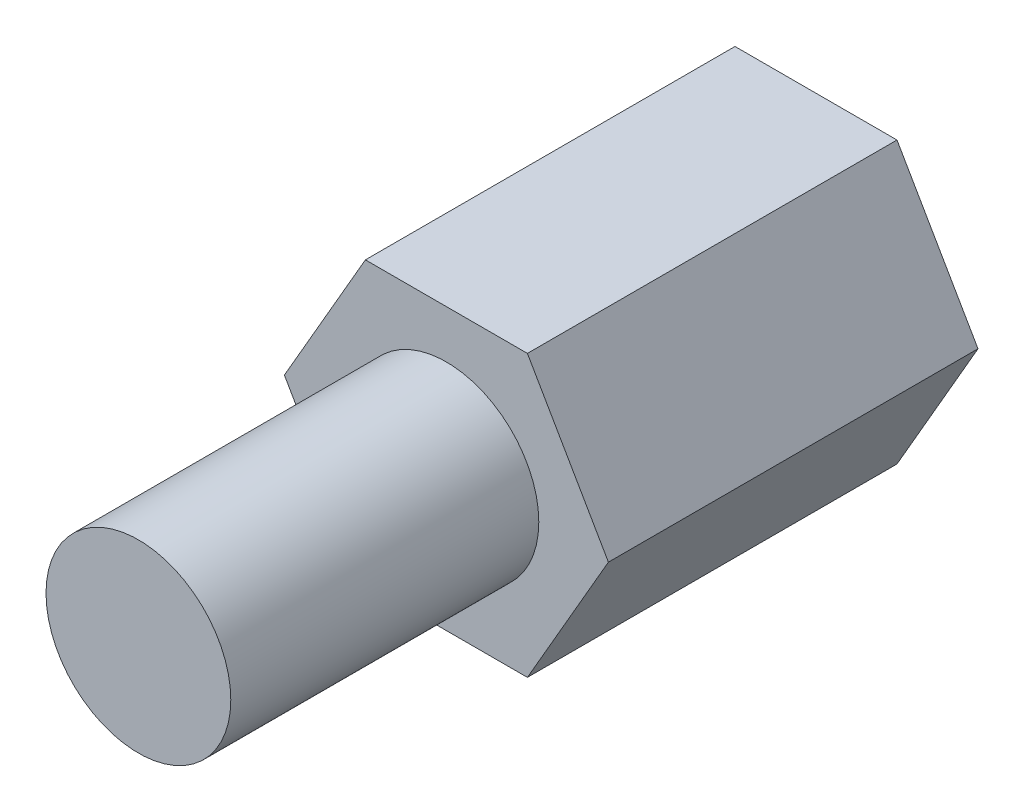
ISO-10303-21;
HEADER;
FILE_DESCRIPTION(('STEP AP214'),'2;1');
FILE_NAME('part.step','',(''),(''),'','','');
FILE_SCHEMA(('AUTOMOTIVE_DESIGN { 1 0 10303 214 1 1 1 1 }'));
ENDSEC;
DATA;
#1=APPLICATION_CONTEXT('core data for automotive mechanical design processes');
#2=APPLICATION_PROTOCOL_DEFINITION('international standard','automotive_design',2000,#1);
#3=PRODUCT_CONTEXT('',#1,'mechanical');
#4=PRODUCT('Part','Part','',(#3));
#5=PRODUCT_RELATED_PRODUCT_CATEGORY('part','',(#4));
#6=PRODUCT_DEFINITION_FORMATION('','',#4);
#7=PRODUCT_DEFINITION_CONTEXT('part definition',#1,'design');
#8=PRODUCT_DEFINITION('design','',#6,#7);
#9=PRODUCT_DEFINITION_SHAPE('','',#8);
#10=(LENGTH_UNIT() NAMED_UNIT(*) SI_UNIT(.MILLI.,.METRE.));
#11=(NAMED_UNIT(*) PLANE_ANGLE_UNIT() SI_UNIT($,.RADIAN.));
#12=(NAMED_UNIT(*) SI_UNIT($,.STERADIAN.) SOLID_ANGLE_UNIT());
#13=UNCERTAINTY_MEASURE_WITH_UNIT(LENGTH_MEASURE(1.E-05),#10,'distance_accuracy_value','');
#14=(GEOMETRIC_REPRESENTATION_CONTEXT(3) GLOBAL_UNCERTAINTY_ASSIGNED_CONTEXT((#13)) GLOBAL_UNIT_ASSIGNED_CONTEXT((#10,
#11,#12)) REPRESENTATION_CONTEXT('',''));
#15=CARTESIAN_POINT('',(0.,0.,0.));
#16=DIRECTION('',(0.,0.,1.));
#17=DIRECTION('',(1.,0.,0.));
#18=AXIS2_PLACEMENT_3D('',#15,#16,#17);
#19=CARTESIAN_POINT('',(1.315,-2.27764681195307,6.));
#20=DIRECTION('',(-0.866025403784439,0.5,0.));
#21=DIRECTION('',(-0.5,-0.866025403784439,0.));
#22=AXIS2_PLACEMENT_3D('',#19,#20,#21);
#23=PLANE('',#22);
#24=DIRECTION('',(0.5,0.866025403784439,0.));
#25=VECTOR('',#24,1.);
#26=CARTESIAN_POINT('',(1.315,-2.27764681195307,0.));
#27=LINE('',#26,#25);
#28=CARTESIAN_POINT('',(1.315,-2.27764681195307,0.));
#29=VERTEX_POINT('',#28);
#30=CARTESIAN_POINT('',(2.63,0.,0.));
#31=VERTEX_POINT('',#30);
#32=EDGE_CURVE('E127',#29,#31,#27,.T.);
#33=ORIENTED_EDGE('',*,*,#32,.T.);
#34=DIRECTION('',(0.,0.,-1.));
#35=VECTOR('',#34,1.);
#36=CARTESIAN_POINT('',(2.63,0.,6.));
#37=LINE('',#36,#35);
#38=CARTESIAN_POINT('',(2.63,0.,6.));
#39=VERTEX_POINT('',#38);
#40=EDGE_CURVE('E42',#39,#31,#37,.T.);
#41=ORIENTED_EDGE('',*,*,#40,.F.);
#42=DIRECTION('',(0.5,0.866025403784439,0.));
#43=VECTOR('',#42,1.);
#44=CARTESIAN_POINT('',(1.315,-2.27764681195307,6.));
#45=LINE('',#44,#43);
#46=CARTESIAN_POINT('',(1.315,-2.27764681195307,6.));
#47=VERTEX_POINT('',#46);
#48=EDGE_CURVE('E138',#47,#39,#45,.T.);
#49=ORIENTED_EDGE('',*,*,#48,.F.);
#50=DIRECTION('',(0.,0.,-1.));
#51=VECTOR('',#50,1.);
#52=CARTESIAN_POINT('',(1.315,-2.27764681195307,6.));
#53=LINE('',#52,#51);
#54=EDGE_CURVE('E123',#47,#29,#53,.T.);
#55=ORIENTED_EDGE('',*,*,#54,.T.);
#56=EDGE_LOOP('',(#33,#41,#49,#55));
#57=FACE_BOUND('',#56,.T.);
#58=ADVANCED_FACE('F39',(#57),#23,.F.);
#59=CARTESIAN_POINT('',(2.63,0.,6.));
#60=DIRECTION('',(-0.866025403784439,-0.5,0.));
#61=DIRECTION('',(0.5,-0.866025403784439,0.));
#62=AXIS2_PLACEMENT_3D('',#59,#60,#61);
#63=PLANE('',#62);
#64=DIRECTION('',(-0.5,0.866025403784439,0.));
#65=VECTOR('',#64,1.);
#66=CARTESIAN_POINT('',(2.63,0.,0.));
#67=LINE('',#66,#65);
#68=CARTESIAN_POINT('',(1.315,2.27764681195307,0.));
#69=VERTEX_POINT('',#68);
#70=EDGE_CURVE('E130',#31,#69,#67,.T.);
#71=ORIENTED_EDGE('',*,*,#70,.T.);
#72=DIRECTION('',(0.,0.,-1.));
#73=VECTOR('',#72,1.);
#74=CARTESIAN_POINT('',(1.315,2.27764681195307,6.));
#75=LINE('',#74,#73);
#76=CARTESIAN_POINT('',(1.315,2.27764681195307,6.));
#77=VERTEX_POINT('',#76);
#78=EDGE_CURVE('E141',#77,#69,#75,.T.);
#79=ORIENTED_EDGE('',*,*,#78,.F.);
#80=DIRECTION('',(-0.5,0.866025403784439,0.));
#81=VECTOR('',#80,1.);
#82=CARTESIAN_POINT('',(2.63,0.,6.));
#83=LINE('',#82,#81);
#84=EDGE_CURVE('E95',#39,#77,#83,.T.);
#85=ORIENTED_EDGE('',*,*,#84,.F.);
#86=ORIENTED_EDGE('',*,*,#40,.T.);
#87=EDGE_LOOP('',(#71,#79,#85,#86));
#88=FACE_BOUND('',#87,.T.);
#89=ADVANCED_FACE('F146',(#88),#63,.F.);
#90=CARTESIAN_POINT('',(1.315,2.27764681195307,6.));
#91=DIRECTION('',(0.,-1.,0.));
#92=DIRECTION('',(1.,0.,0.));
#93=AXIS2_PLACEMENT_3D('',#90,#91,#92);
#94=PLANE('',#93);
#95=DIRECTION('',(-1.,0.,0.));
#96=VECTOR('',#95,1.);
#97=CARTESIAN_POINT('',(1.315,2.27764681195307,0.));
#98=LINE('',#97,#96);
#99=CARTESIAN_POINT('',(-1.315,2.27764681195307,0.));
#100=VERTEX_POINT('',#99);
#101=EDGE_CURVE('E133',#69,#100,#98,.T.);
#102=ORIENTED_EDGE('',*,*,#101,.T.);
#103=DIRECTION('',(0.,0.,-1.));
#104=VECTOR('',#103,1.);
#105=CARTESIAN_POINT('',(-1.315,2.27764681195307,6.));
#106=LINE('',#105,#104);
#107=CARTESIAN_POINT('',(-1.315,2.27764681195307,6.));
#108=VERTEX_POINT('',#107);
#109=EDGE_CURVE('E118',#108,#100,#106,.T.);
#110=ORIENTED_EDGE('',*,*,#109,.F.);
#111=DIRECTION('',(-1.,0.,0.));
#112=VECTOR('',#111,1.);
#113=CARTESIAN_POINT('',(1.315,2.27764681195307,6.));
#114=LINE('',#113,#112);
#115=EDGE_CURVE('E109',#77,#108,#114,.T.);
#116=ORIENTED_EDGE('',*,*,#115,.F.);
#117=ORIENTED_EDGE('',*,*,#78,.T.);
#118=EDGE_LOOP('',(#102,#110,#116,#117));
#119=FACE_BOUND('',#118,.T.);
#120=ADVANCED_FACE('F152',(#119),#94,.F.);
#121=CARTESIAN_POINT('',(-1.315,2.27764681195307,6.));
#122=DIRECTION('',(0.866025403784438,-0.5,0.));
#123=DIRECTION('',(0.5,0.866025403784439,0.));
#124=AXIS2_PLACEMENT_3D('',#121,#122,#123);
#125=PLANE('',#124);
#126=DIRECTION('',(-0.5,-0.866025403784439,0.));
#127=VECTOR('',#126,1.);
#128=CARTESIAN_POINT('',(-1.315,2.27764681195307,0.));
#129=LINE('',#128,#127);
#130=CARTESIAN_POINT('',(-2.63,0.,0.));
#131=VERTEX_POINT('',#130);
#132=EDGE_CURVE('E117',#100,#131,#129,.T.);
#133=ORIENTED_EDGE('',*,*,#132,.T.);
#134=DIRECTION('',(0.,0.,-1.));
#135=VECTOR('',#134,1.);
#136=CARTESIAN_POINT('',(-2.63,0.,6.));
#137=LINE('',#136,#135);
#138=CARTESIAN_POINT('',(-2.63,0.,6.));
#139=VERTEX_POINT('',#138);
#140=EDGE_CURVE('E114',#139,#131,#137,.T.);
#141=ORIENTED_EDGE('',*,*,#140,.F.);
#142=DIRECTION('',(-0.5,-0.866025403784439,0.));
#143=VECTOR('',#142,1.);
#144=CARTESIAN_POINT('',(-1.315,2.27764681195307,6.));
#145=LINE('',#144,#143);
#146=EDGE_CURVE('E103',#108,#139,#145,.T.);
#147=ORIENTED_EDGE('',*,*,#146,.F.);
#148=ORIENTED_EDGE('',*,*,#109,.T.);
#149=EDGE_LOOP('',(#133,#141,#147,#148));
#150=FACE_BOUND('',#149,.T.);
#151=ADVANCED_FACE('F115',(#150),#125,.F.);
#152=CARTESIAN_POINT('',(-2.63,0.,6.));
#153=DIRECTION('',(0.866025403784439,0.5,0.));
#154=DIRECTION('',(-0.5,0.866025403784439,0.));
#155=AXIS2_PLACEMENT_3D('',#152,#153,#154);
#156=PLANE('',#155);
#157=DIRECTION('',(0.5,-0.866025403784439,0.));
#158=VECTOR('',#157,1.);
#159=CARTESIAN_POINT('',(-2.63,0.,0.));
#160=LINE('',#159,#158);
#161=CARTESIAN_POINT('',(-1.315,-2.27764681195307,0.));
#162=VERTEX_POINT('',#161);
#163=EDGE_CURVE('E80',#131,#162,#160,.T.);
#164=ORIENTED_EDGE('',*,*,#163,.T.);
#165=DIRECTION('',(0.,0.,-1.));
#166=VECTOR('',#165,1.);
#167=CARTESIAN_POINT('',(-1.315,-2.27764681195307,6.));
#168=LINE('',#167,#166);
#169=CARTESIAN_POINT('',(-1.315,-2.27764681195307,6.));
#170=VERTEX_POINT('',#169);
#171=EDGE_CURVE('E119',#170,#162,#168,.T.);
#172=ORIENTED_EDGE('',*,*,#171,.F.);
#173=DIRECTION('',(0.5,-0.866025403784439,0.));
#174=VECTOR('',#173,1.);
#175=CARTESIAN_POINT('',(-2.63,0.,6.));
#176=LINE('',#175,#174);
#177=EDGE_CURVE('E107',#139,#170,#176,.T.);
#178=ORIENTED_EDGE('',*,*,#177,.F.);
#179=ORIENTED_EDGE('',*,*,#140,.T.);
#180=EDGE_LOOP('',(#164,#172,#178,#179));
#181=FACE_BOUND('',#180,.T.);
#182=ADVANCED_FACE('F121',(#181),#156,.F.);
#183=CARTESIAN_POINT('',(-1.315,-2.27764681195307,6.));
#184=DIRECTION('',(0.,1.,0.));
#185=DIRECTION('',(-1.,0.,0.));
#186=AXIS2_PLACEMENT_3D('',#183,#184,#185);
#187=PLANE('',#186);
#188=DIRECTION('',(1.,0.,0.));
#189=VECTOR('',#188,1.);
#190=CARTESIAN_POINT('',(-1.315,-2.27764681195307,0.));
#191=LINE('',#190,#189);
#192=EDGE_CURVE('E86',#162,#29,#191,.T.);
#193=ORIENTED_EDGE('',*,*,#192,.T.);
#194=ORIENTED_EDGE('',*,*,#54,.F.);
#195=DIRECTION('',(1.,0.,0.));
#196=VECTOR('',#195,1.);
#197=CARTESIAN_POINT('',(-1.315,-2.27764681195307,6.));
#198=LINE('',#197,#196);
#199=EDGE_CURVE('E56',#170,#47,#198,.T.);
#200=ORIENTED_EDGE('',*,*,#199,.F.);
#201=ORIENTED_EDGE('',*,*,#171,.T.);
#202=EDGE_LOOP('',(#193,#194,#200,#201));
#203=FACE_BOUND('',#202,.T.);
#204=ADVANCED_FACE('F175',(#203),#187,.F.);
#205=CARTESIAN_POINT('',(0.,0.,6.));
#206=DIRECTION('',(0.,0.,1.));
#207=DIRECTION('',(1.,0.,0.));
#208=AXIS2_PLACEMENT_3D('',#205,#206,#207);
#209=PLANE('',#208);
#210=CARTESIAN_POINT('',(0.,0.,6.));
#211=DIRECTION('',(0.,0.,1.));
#212=DIRECTION('',(1.,0.,0.));
#213=AXIS2_PLACEMENT_3D('',#210,#211,#212);
#214=CIRCLE('',#213,1.5);
#215=CARTESIAN_POINT('',(1.5,0.,6.));
#216=VERTEX_POINT('',#215);
#217=EDGE_CURVE('E11',#216,#216,#214,.T.);
#218=ORIENTED_EDGE('',*,*,#217,.F.);
#219=EDGE_LOOP('',(#218));
#220=FACE_BOUND('',#219,.T.);
#221=ORIENTED_EDGE('',*,*,#48,.T.);
#222=ORIENTED_EDGE('',*,*,#84,.T.);
#223=ORIENTED_EDGE('',*,*,#115,.T.);
#224=ORIENTED_EDGE('',*,*,#146,.T.);
#225=ORIENTED_EDGE('',*,*,#177,.T.);
#226=ORIENTED_EDGE('',*,*,#199,.T.);
#227=EDGE_LOOP('',(#221,#222,#223,#224,#225,#226));
#228=FACE_BOUND('',#227,.T.);
#229=ADVANCED_FACE('F105',(#220,#228),#209,.T.);
#230=CARTESIAN_POINT('',(0.,0.,0.));
#231=DIRECTION('',(0.,0.,1.));
#232=DIRECTION('',(1.,0.,0.));
#233=AXIS2_PLACEMENT_3D('',#230,#231,#232);
#234=PLANE('',#233);
#235=CARTESIAN_POINT('',(0.,0.,0.));
#236=DIRECTION('',(0.,0.,-1.));
#237=DIRECTION('',(-1.,0.,0.));
#238=AXIS2_PLACEMENT_3D('',#235,#236,#237);
#239=CIRCLE('',#238,1.25);
#240=CARTESIAN_POINT('',(-1.25,0.,0.));
#241=VERTEX_POINT('',#240);
#242=EDGE_CURVE('E158',#241,#241,#239,.T.);
#243=ORIENTED_EDGE('',*,*,#242,.F.);
#244=EDGE_LOOP('',(#243));
#245=FACE_BOUND('',#244,.T.);
#246=ORIENTED_EDGE('',*,*,#32,.F.);
#247=ORIENTED_EDGE('',*,*,#192,.F.);
#248=ORIENTED_EDGE('',*,*,#163,.F.);
#249=ORIENTED_EDGE('',*,*,#132,.F.);
#250=ORIENTED_EDGE('',*,*,#101,.F.);
#251=ORIENTED_EDGE('',*,*,#70,.F.);
#252=EDGE_LOOP('',(#246,#247,#248,#249,#250,#251));
#253=FACE_BOUND('',#252,.T.);
#254=ADVANCED_FACE('F151',(#245,#253),#234,.F.);
#255=CARTESIAN_POINT('',(0.,0.,4.));
#256=DIRECTION('',(0.,0.,-1.));
#257=DIRECTION('',(-1.,0.,0.));
#258=AXIS2_PLACEMENT_3D('',#255,#256,#257);
#259=CONICAL_SURFACE('',#258,1.25,1.02974425867665);
#260=CARTESIAN_POINT('',(0.,0.,4.75107577378445));
#261=VERTEX_POINT('',#260);
#262=VERTEX_LOOP('',#261);
#263=FACE_BOUND('',#262,.T.);
#264=CARTESIAN_POINT('',(0.,0.,4.));
#265=DIRECTION('',(0.,0.,-1.));
#266=DIRECTION('',(-1.,0.,0.));
#267=AXIS2_PLACEMENT_3D('',#264,#265,#266);
#268=CIRCLE('',#267,1.25);
#269=CARTESIAN_POINT('',(-1.25,0.,4.));
#270=VERTEX_POINT('',#269);
#271=EDGE_CURVE('E131',#270,#270,#268,.T.);
#272=ORIENTED_EDGE('',*,*,#271,.T.);
#273=EDGE_LOOP('',(#272));
#274=FACE_BOUND('',#273,.T.);
#275=ADVANCED_FACE('F181',(#263,#274),#259,.F.);
#276=CARTESIAN_POINT('',(0.,0.,0.));
#277=DIRECTION('',(0.,0.,-1.));
#278=DIRECTION('',(-1.,0.,0.));
#279=AXIS2_PLACEMENT_3D('',#276,#277,#278);
#280=CYLINDRICAL_SURFACE('',#279,1.25);
#281=ORIENTED_EDGE('',*,*,#271,.F.);
#282=EDGE_LOOP('',(#281));
#283=FACE_BOUND('',#282,.T.);
#284=ORIENTED_EDGE('',*,*,#242,.T.);
#285=EDGE_LOOP('',(#284));
#286=FACE_BOUND('',#285,.T.);
#287=ADVANCED_FACE('F170',(#283,#286),#280,.F.);
#288=CARTESIAN_POINT('',(0.,0.,11.));
#289=DIRECTION('',(0.,0.,-1.));
#290=DIRECTION('',(-1.,0.,0.));
#291=AXIS2_PLACEMENT_3D('',#288,#289,#290);
#292=CYLINDRICAL_SURFACE('',#291,1.5);
#293=CARTESIAN_POINT('',(0.,0.,11.));
#294=DIRECTION('',(0.,0.,1.));
#295=DIRECTION('',(1.,0.,0.));
#296=AXIS2_PLACEMENT_3D('',#293,#294,#295);
#297=CIRCLE('',#296,1.5);
#298=CARTESIAN_POINT('',(1.5,0.,11.));
#299=VERTEX_POINT('',#298);
#300=EDGE_CURVE('E160',#299,#299,#297,.T.);
#301=ORIENTED_EDGE('',*,*,#300,.F.);
#302=EDGE_LOOP('',(#301));
#303=FACE_BOUND('',#302,.T.);
#304=ORIENTED_EDGE('',*,*,#217,.T.);
#305=EDGE_LOOP('',(#304));
#306=FACE_BOUND('',#305,.T.);
#307=ADVANCED_FACE('F167',(#303,#306),#292,.T.);
#308=CARTESIAN_POINT('',(0.,0.,11.));
#309=DIRECTION('',(0.,0.,1.));
#310=DIRECTION('',(1.,0.,0.));
#311=AXIS2_PLACEMENT_3D('',#308,#309,#310);
#312=PLANE('',#311);
#313=ORIENTED_EDGE('',*,*,#300,.T.);
#314=EDGE_LOOP('',(#313));
#315=FACE_BOUND('',#314,.T.);
#316=ADVANCED_FACE('F165',(#315),#312,.T.);
#317=CLOSED_SHELL('',(#58,#89,#120,#151,#182,#204,#229,#254,#275,#287,#307,#316));
#318=MANIFOLD_SOLID_BREP('B2',#317);
#319=ADVANCED_BREP_SHAPE_REPRESENTATION('',(#18,#318),#14);
#320=SHAPE_DEFINITION_REPRESENTATION(#9,#319);
ENDSEC;
END-ISO-10303-21;
